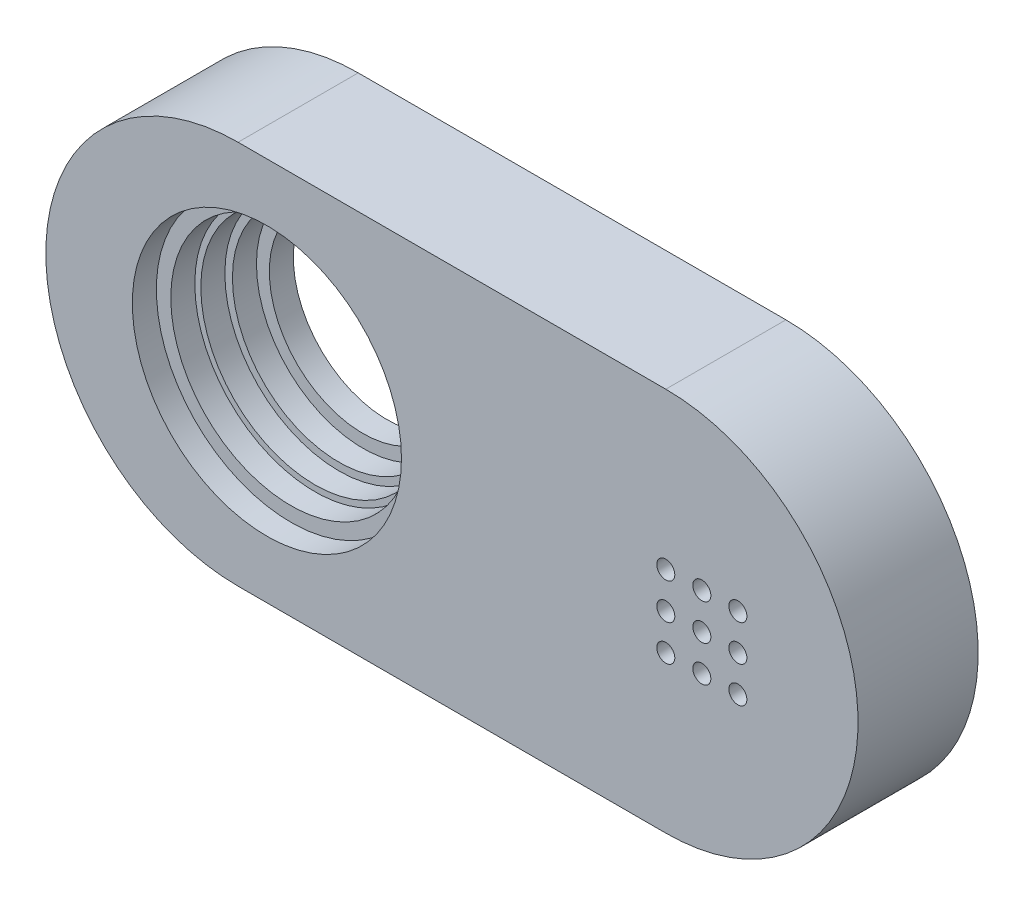
ISO-10303-21;
HEADER;
FILE_DESCRIPTION(('STEP AP214'),'2;1');
FILE_NAME('part.step','',(''),(''),'','','');
FILE_SCHEMA(('AUTOMOTIVE_DESIGN { 1 0 10303 214 1 1 1 1 }'));
ENDSEC;
DATA;
#1=APPLICATION_CONTEXT('core data for automotive mechanical design processes');
#2=APPLICATION_PROTOCOL_DEFINITION('international standard','automotive_design',2000,#1);
#3=PRODUCT_CONTEXT('',#1,'mechanical');
#4=PRODUCT('Part','Part','',(#3));
#5=PRODUCT_RELATED_PRODUCT_CATEGORY('part','',(#4));
#6=PRODUCT_DEFINITION_FORMATION('','',#4);
#7=PRODUCT_DEFINITION_CONTEXT('part definition',#1,'design');
#8=PRODUCT_DEFINITION('design','',#6,#7);
#9=PRODUCT_DEFINITION_SHAPE('','',#8);
#10=(LENGTH_UNIT() NAMED_UNIT(*) SI_UNIT(.MILLI.,.METRE.));
#11=(NAMED_UNIT(*) PLANE_ANGLE_UNIT() SI_UNIT($,.RADIAN.));
#12=(NAMED_UNIT(*) SI_UNIT($,.STERADIAN.) SOLID_ANGLE_UNIT());
#13=UNCERTAINTY_MEASURE_WITH_UNIT(LENGTH_MEASURE(1.E-05),#10,'distance_accuracy_value','');
#14=(GEOMETRIC_REPRESENTATION_CONTEXT(3) GLOBAL_UNCERTAINTY_ASSIGNED_CONTEXT((#13)) GLOBAL_UNIT_ASSIGNED_CONTEXT((#10,
#11,#12)) REPRESENTATION_CONTEXT('',''));
#15=CARTESIAN_POINT('',(0.,0.,0.));
#16=DIRECTION('',(0.,0.,1.));
#17=DIRECTION('',(1.,0.,0.));
#18=AXIS2_PLACEMENT_3D('',#15,#16,#17);
#19=CARTESIAN_POINT('',(-7.7,0.,3.));
#20=DIRECTION('',(0.,0.,1.));
#21=DIRECTION('',(1.,0.,0.));
#22=AXIS2_PLACEMENT_3D('',#19,#20,#21);
#23=CYLINDRICAL_SURFACE('',#22,5.);
#24=CARTESIAN_POINT('',(-7.7,0.,3.));
#25=DIRECTION('',(0.,0.,1.));
#26=DIRECTION('',(1.,0.,0.));
#27=AXIS2_PLACEMENT_3D('',#24,#25,#26);
#28=CIRCLE('',#27,5.);
#29=CARTESIAN_POINT('',(-2.7,0.,3.));
#30=VERTEX_POINT('',#29);
#31=EDGE_CURVE('E117',#30,#30,#28,.T.);
#32=ORIENTED_EDGE('',*,*,#31,.F.);
#33=EDGE_LOOP('',(#32));
#34=FACE_BOUND('',#33,.T.);
#35=CARTESIAN_POINT('',(-7.7,0.,4.));
#36=DIRECTION('',(0.,0.,1.));
#37=DIRECTION('',(1.,0.,0.));
#38=AXIS2_PLACEMENT_3D('',#35,#36,#37);
#39=CIRCLE('',#38,5.);
#40=CARTESIAN_POINT('',(-2.7,0.,4.));
#41=VERTEX_POINT('',#40);
#42=EDGE_CURVE('E36',#41,#41,#39,.F.);
#43=ORIENTED_EDGE('',*,*,#42,.F.);
#44=EDGE_LOOP('',(#43));
#45=FACE_BOUND('',#44,.T.);
#46=ADVANCED_FACE('F32',(#34,#45),#23,.F.);
#47=CARTESIAN_POINT('',(-7.7,0.,2.));
#48=DIRECTION('',(0.,0.,1.));
#49=DIRECTION('',(1.,0.,0.));
#50=AXIS2_PLACEMENT_3D('',#47,#48,#49);
#51=CYLINDRICAL_SURFACE('',#50,4.75);
#52=CARTESIAN_POINT('',(-7.7,0.,2.));
#53=DIRECTION('',(0.,0.,1.));
#54=DIRECTION('',(1.,0.,0.));
#55=AXIS2_PLACEMENT_3D('',#52,#53,#54);
#56=CIRCLE('',#55,4.75);
#57=CARTESIAN_POINT('',(-2.95,0.,2.));
#58=VERTEX_POINT('',#57);
#59=EDGE_CURVE('E114',#58,#58,#56,.T.);
#60=ORIENTED_EDGE('',*,*,#59,.F.);
#61=EDGE_LOOP('',(#60));
#62=FACE_BOUND('',#61,.T.);
#63=CARTESIAN_POINT('',(-7.7,0.,3.));
#64=DIRECTION('',(0.,0.,1.));
#65=DIRECTION('',(1.,0.,0.));
#66=AXIS2_PLACEMENT_3D('',#63,#64,#65);
#67=CIRCLE('',#66,4.75);
#68=CARTESIAN_POINT('',(-2.95,0.,3.));
#69=VERTEX_POINT('',#68);
#70=EDGE_CURVE('E115',#69,#69,#67,.F.);
#71=ORIENTED_EDGE('',*,*,#70,.F.);
#72=EDGE_LOOP('',(#71));
#73=FACE_BOUND('',#72,.T.);
#74=ADVANCED_FACE('F164',(#62,#73),#51,.F.);
#75=CARTESIAN_POINT('',(-7.7,0.,1.));
#76=DIRECTION('',(0.,0.,1.));
#77=DIRECTION('',(1.,0.,0.));
#78=AXIS2_PLACEMENT_3D('',#75,#76,#77);
#79=CYLINDRICAL_SURFACE('',#78,4.435);
#80=CARTESIAN_POINT('',(-7.7,0.,1.));
#81=DIRECTION('',(0.,0.,1.));
#82=DIRECTION('',(1.,0.,0.));
#83=AXIS2_PLACEMENT_3D('',#80,#81,#82);
#84=CIRCLE('',#83,4.435);
#85=CARTESIAN_POINT('',(-3.265,0.,1.));
#86=VERTEX_POINT('',#85);
#87=EDGE_CURVE('E111',#86,#86,#84,.T.);
#88=ORIENTED_EDGE('',*,*,#87,.F.);
#89=EDGE_LOOP('',(#88));
#90=FACE_BOUND('',#89,.T.);
#91=CARTESIAN_POINT('',(-7.7,0.,2.));
#92=DIRECTION('',(0.,0.,1.));
#93=DIRECTION('',(1.,0.,0.));
#94=AXIS2_PLACEMENT_3D('',#91,#92,#93);
#95=CIRCLE('',#94,4.435);
#96=CARTESIAN_POINT('',(-3.265,0.,2.));
#97=VERTEX_POINT('',#96);
#98=EDGE_CURVE('E112',#97,#97,#95,.F.);
#99=ORIENTED_EDGE('',*,*,#98,.F.);
#100=EDGE_LOOP('',(#99));
#101=FACE_BOUND('',#100,.T.);
#102=ADVANCED_FACE('F143',(#90,#101),#79,.F.);
#103=CARTESIAN_POINT('',(-7.7,0.,0.));
#104=DIRECTION('',(0.,0.,1.));
#105=DIRECTION('',(1.,0.,0.));
#106=AXIS2_PLACEMENT_3D('',#103,#104,#105);
#107=CYLINDRICAL_SURFACE('',#106,3.9);
#108=CARTESIAN_POINT('',(-7.7,0.,0.));
#109=DIRECTION('',(0.,0.,1.));
#110=DIRECTION('',(1.,0.,0.));
#111=AXIS2_PLACEMENT_3D('',#108,#109,#110);
#112=CIRCLE('',#111,3.9);
#113=CARTESIAN_POINT('',(-3.8,0.,0.));
#114=VERTEX_POINT('',#113);
#115=EDGE_CURVE('E102',#114,#114,#112,.T.);
#116=ORIENTED_EDGE('',*,*,#115,.F.);
#117=EDGE_LOOP('',(#116));
#118=FACE_BOUND('',#117,.T.);
#119=CARTESIAN_POINT('',(-7.7,0.,1.));
#120=DIRECTION('',(0.,0.,1.));
#121=DIRECTION('',(1.,0.,0.));
#122=AXIS2_PLACEMENT_3D('',#119,#120,#121);
#123=CIRCLE('',#122,3.9);
#124=CARTESIAN_POINT('',(-3.8,0.,1.));
#125=VERTEX_POINT('',#124);
#126=EDGE_CURVE('E108',#125,#125,#123,.F.);
#127=ORIENTED_EDGE('',*,*,#126,.F.);
#128=EDGE_LOOP('',(#127));
#129=FACE_BOUND('',#128,.T.);
#130=ADVANCED_FACE('F140',(#118,#129),#107,.F.);
#131=CARTESIAN_POINT('',(-8.9,0.,5.));
#132=DIRECTION('',(0.,0.,-1.));
#133=DIRECTION('',(-1.,0.,0.));
#134=AXIS2_PLACEMENT_3D('',#131,#132,#133);
#135=CYLINDRICAL_SURFACE('',#134,8.);
#136=CARTESIAN_POINT('',(-8.9,0.,0.));
#137=DIRECTION('',(0.,0.,1.));
#138=DIRECTION('',(1.,0.,0.));
#139=AXIS2_PLACEMENT_3D('',#136,#137,#138);
#140=CIRCLE('',#139,8.);
#141=CARTESIAN_POINT('',(-8.9,8.,0.));
#142=VERTEX_POINT('',#141);
#143=CARTESIAN_POINT('',(-8.9,-8.,0.));
#144=VERTEX_POINT('',#143);
#145=EDGE_CURVE('E99',#142,#144,#140,.T.);
#146=ORIENTED_EDGE('',*,*,#145,.T.);
#147=DIRECTION('',(0.,0.,-1.));
#148=VECTOR('',#147,1.);
#149=CARTESIAN_POINT('',(-8.9,-8.,5.));
#150=LINE('',#149,#148);
#151=CARTESIAN_POINT('',(-8.9,-8.,5.));
#152=VERTEX_POINT('',#151);
#153=EDGE_CURVE('E11',#152,#144,#150,.T.);
#154=ORIENTED_EDGE('',*,*,#153,.F.);
#155=CARTESIAN_POINT('',(-8.9,0.,5.));
#156=DIRECTION('',(0.,0.,1.));
#157=DIRECTION('',(1.,0.,0.));
#158=AXIS2_PLACEMENT_3D('',#155,#156,#157);
#159=CIRCLE('',#158,8.);
#160=CARTESIAN_POINT('',(-8.9,8.,5.));
#161=VERTEX_POINT('',#160);
#162=EDGE_CURVE('E86',#161,#152,#159,.T.);
#163=ORIENTED_EDGE('',*,*,#162,.F.);
#164=DIRECTION('',(0.,0.,-1.));
#165=VECTOR('',#164,1.);
#166=CARTESIAN_POINT('',(-8.9,8.,5.));
#167=LINE('',#166,#165);
#168=EDGE_CURVE('E95',#161,#142,#167,.T.);
#169=ORIENTED_EDGE('',*,*,#168,.T.);
#170=EDGE_LOOP('',(#146,#154,#163,#169));
#171=FACE_BOUND('',#170,.T.);
#172=ADVANCED_FACE('F34',(#171),#135,.T.);
#173=CARTESIAN_POINT('',(-8.9,-8.,5.));
#174=DIRECTION('',(0.,1.,0.));
#175=DIRECTION('',(-1.,0.,0.));
#176=AXIS2_PLACEMENT_3D('',#173,#174,#175);
#177=PLANE('',#176);
#178=DIRECTION('',(1.,0.,0.));
#179=VECTOR('',#178,1.);
#180=CARTESIAN_POINT('',(-8.9,-8.,0.));
#181=LINE('',#180,#179);
#182=CARTESIAN_POINT('',(8.9,-8.,0.));
#183=VERTEX_POINT('',#182);
#184=EDGE_CURVE('E90',#144,#183,#181,.T.);
#185=ORIENTED_EDGE('',*,*,#184,.T.);
#186=DIRECTION('',(0.,0.,-1.));
#187=VECTOR('',#186,1.);
#188=CARTESIAN_POINT('',(8.9,-8.,5.));
#189=LINE('',#188,#187);
#190=CARTESIAN_POINT('',(8.9,-8.,5.));
#191=VERTEX_POINT('',#190);
#192=EDGE_CURVE('E42',#191,#183,#189,.T.);
#193=ORIENTED_EDGE('',*,*,#192,.F.);
#194=DIRECTION('',(1.,0.,0.));
#195=VECTOR('',#194,1.);
#196=CARTESIAN_POINT('',(-8.9,-8.,5.));
#197=LINE('',#196,#195);
#198=EDGE_CURVE('E81',#152,#191,#197,.T.);
#199=ORIENTED_EDGE('',*,*,#198,.F.);
#200=ORIENTED_EDGE('',*,*,#153,.T.);
#201=EDGE_LOOP('',(#185,#193,#199,#200));
#202=FACE_BOUND('',#201,.T.);
#203=ADVANCED_FACE('F89',(#202),#177,.F.);
#204=CARTESIAN_POINT('',(8.9,0.,5.));
#205=DIRECTION('',(0.,0.,-1.));
#206=DIRECTION('',(-1.,0.,0.));
#207=AXIS2_PLACEMENT_3D('',#204,#205,#206);
#208=CYLINDRICAL_SURFACE('',#207,8.);
#209=CARTESIAN_POINT('',(8.9,0.,0.));
#210=DIRECTION('',(0.,0.,1.));
#211=DIRECTION('',(1.,0.,0.));
#212=AXIS2_PLACEMENT_3D('',#209,#210,#211);
#213=CIRCLE('',#212,8.);
#214=CARTESIAN_POINT('',(8.9,8.,0.));
#215=VERTEX_POINT('',#214);
#216=EDGE_CURVE('E68',#183,#215,#213,.T.);
#217=ORIENTED_EDGE('',*,*,#216,.T.);
#218=DIRECTION('',(0.,0.,-1.));
#219=VECTOR('',#218,1.);
#220=CARTESIAN_POINT('',(8.9,8.,5.));
#221=LINE('',#220,#219);
#222=CARTESIAN_POINT('',(8.9,8.,5.));
#223=VERTEX_POINT('',#222);
#224=EDGE_CURVE('E91',#223,#215,#221,.T.);
#225=ORIENTED_EDGE('',*,*,#224,.F.);
#226=CARTESIAN_POINT('',(8.9,0.,5.));
#227=DIRECTION('',(0.,0.,1.));
#228=DIRECTION('',(1.,0.,0.));
#229=AXIS2_PLACEMENT_3D('',#226,#227,#228);
#230=CIRCLE('',#229,8.);
#231=EDGE_CURVE('E84',#191,#223,#230,.T.);
#232=ORIENTED_EDGE('',*,*,#231,.F.);
#233=ORIENTED_EDGE('',*,*,#192,.T.);
#234=EDGE_LOOP('',(#217,#225,#232,#233));
#235=FACE_BOUND('',#234,.T.);
#236=ADVANCED_FACE('F93',(#235),#208,.T.);
#237=CARTESIAN_POINT('',(-8.9,8.,5.));
#238=DIRECTION('',(0.,-1.,0.));
#239=DIRECTION('',(1.,0.,0.));
#240=AXIS2_PLACEMENT_3D('',#237,#238,#239);
#241=PLANE('',#240);
#242=DIRECTION('',(-1.,0.,0.));
#243=VECTOR('',#242,1.);
#244=CARTESIAN_POINT('',(-8.9,8.,0.));
#245=LINE('',#244,#243);
#246=EDGE_CURVE('E74',#215,#142,#245,.T.);
#247=ORIENTED_EDGE('',*,*,#246,.T.);
#248=ORIENTED_EDGE('',*,*,#168,.F.);
#249=DIRECTION('',(-1.,0.,0.));
#250=VECTOR('',#249,1.);
#251=CARTESIAN_POINT('',(-8.9,8.,5.));
#252=LINE('',#251,#250);
#253=EDGE_CURVE('E51',#223,#161,#252,.T.);
#254=ORIENTED_EDGE('',*,*,#253,.F.);
#255=ORIENTED_EDGE('',*,*,#224,.T.);
#256=EDGE_LOOP('',(#247,#248,#254,#255));
#257=FACE_BOUND('',#256,.T.);
#258=ADVANCED_FACE('F285',(#257),#241,.F.);
#259=CARTESIAN_POINT('',(-8.9,0.,5.));
#260=DIRECTION('',(0.,0.,1.));
#261=DIRECTION('',(1.,0.,0.));
#262=AXIS2_PLACEMENT_3D('',#259,#260,#261);
#263=PLANE('',#262);
#264=CARTESIAN_POINT('',(11.9,1.5,5.));
#265=DIRECTION('',(0.,0.,1.));
#266=DIRECTION('',(1.,0.,0.));
#267=AXIS2_PLACEMENT_3D('',#264,#265,#266);
#268=CIRCLE('',#267,0.375000000000001);
#269=CARTESIAN_POINT('',(12.275,1.5,5.));
#270=VERTEX_POINT('',#269);
#271=EDGE_CURVE('E226',#270,#270,#268,.T.);
#272=ORIENTED_EDGE('',*,*,#271,.F.);
#273=EDGE_LOOP('',(#272));
#274=FACE_BOUND('',#273,.T.);
#275=CARTESIAN_POINT('',(10.4,1.5,5.));
#276=DIRECTION('',(0.,0.,1.));
#277=DIRECTION('',(1.,0.,0.));
#278=AXIS2_PLACEMENT_3D('',#275,#276,#277);
#279=CIRCLE('',#278,0.375000000000001);
#280=CARTESIAN_POINT('',(10.775,1.5,5.));
#281=VERTEX_POINT('',#280);
#282=EDGE_CURVE('E229',#281,#281,#279,.T.);
#283=ORIENTED_EDGE('',*,*,#282,.F.);
#284=EDGE_LOOP('',(#283));
#285=FACE_BOUND('',#284,.T.);
#286=CARTESIAN_POINT('',(8.9,1.5,5.));
#287=DIRECTION('',(0.,0.,1.));
#288=DIRECTION('',(1.,0.,0.));
#289=AXIS2_PLACEMENT_3D('',#286,#287,#288);
#290=CIRCLE('',#289,0.375000000000001);
#291=CARTESIAN_POINT('',(9.275,1.5,5.));
#292=VERTEX_POINT('',#291);
#293=EDGE_CURVE('E235',#292,#292,#290,.T.);
#294=ORIENTED_EDGE('',*,*,#293,.F.);
#295=EDGE_LOOP('',(#294));
#296=FACE_BOUND('',#295,.T.);
#297=CARTESIAN_POINT('',(11.9,-1.5,5.));
#298=DIRECTION('',(0.,0.,1.));
#299=DIRECTION('',(1.,0.,0.));
#300=AXIS2_PLACEMENT_3D('',#297,#298,#299);
#301=CIRCLE('',#300,0.375000000000001);
#302=CARTESIAN_POINT('',(12.275,-1.5,5.));
#303=VERTEX_POINT('',#302);
#304=EDGE_CURVE('E241',#303,#303,#301,.T.);
#305=ORIENTED_EDGE('',*,*,#304,.F.);
#306=EDGE_LOOP('',(#305));
#307=FACE_BOUND('',#306,.T.);
#308=CARTESIAN_POINT('',(10.4,-1.5,5.));
#309=DIRECTION('',(0.,0.,1.));
#310=DIRECTION('',(1.,0.,0.));
#311=AXIS2_PLACEMENT_3D('',#308,#309,#310);
#312=CIRCLE('',#311,0.375000000000001);
#313=CARTESIAN_POINT('',(10.775,-1.5,5.));
#314=VERTEX_POINT('',#313);
#315=EDGE_CURVE('E247',#314,#314,#312,.T.);
#316=ORIENTED_EDGE('',*,*,#315,.F.);
#317=EDGE_LOOP('',(#316));
#318=FACE_BOUND('',#317,.T.);
#319=CARTESIAN_POINT('',(8.9,-1.5,5.));
#320=DIRECTION('',(0.,0.,1.));
#321=DIRECTION('',(1.,0.,0.));
#322=AXIS2_PLACEMENT_3D('',#319,#320,#321);
#323=CIRCLE('',#322,0.375000000000001);
#324=CARTESIAN_POINT('',(9.275,-1.5,5.));
#325=VERTEX_POINT('',#324);
#326=EDGE_CURVE('E253',#325,#325,#323,.T.);
#327=ORIENTED_EDGE('',*,*,#326,.F.);
#328=EDGE_LOOP('',(#327));
#329=FACE_BOUND('',#328,.T.);
#330=CARTESIAN_POINT('',(11.9,0.,5.));
#331=DIRECTION('',(0.,0.,1.));
#332=DIRECTION('',(1.,0.,0.));
#333=AXIS2_PLACEMENT_3D('',#330,#331,#332);
#334=CIRCLE('',#333,0.375000000000001);
#335=CARTESIAN_POINT('',(12.275,0.,5.));
#336=VERTEX_POINT('',#335);
#337=EDGE_CURVE('E259',#336,#336,#334,.T.);
#338=ORIENTED_EDGE('',*,*,#337,.F.);
#339=EDGE_LOOP('',(#338));
#340=FACE_BOUND('',#339,.T.);
#341=CARTESIAN_POINT('',(8.9,0.,5.));
#342=DIRECTION('',(0.,0.,1.));
#343=DIRECTION('',(1.,0.,0.));
#344=AXIS2_PLACEMENT_3D('',#341,#342,#343);
#345=CIRCLE('',#344,0.375000000000001);
#346=CARTESIAN_POINT('',(9.275,0.,5.));
#347=VERTEX_POINT('',#346);
#348=EDGE_CURVE('E265',#347,#347,#345,.T.);
#349=ORIENTED_EDGE('',*,*,#348,.F.);
#350=EDGE_LOOP('',(#349));
#351=FACE_BOUND('',#350,.T.);
#352=CARTESIAN_POINT('',(10.4,0.,5.));
#353=DIRECTION('',(0.,0.,1.));
#354=DIRECTION('',(1.,0.,0.));
#355=AXIS2_PLACEMENT_3D('',#352,#353,#354);
#356=CIRCLE('',#355,0.375000000000001);
#357=CARTESIAN_POINT('',(10.775,0.,5.));
#358=VERTEX_POINT('',#357);
#359=EDGE_CURVE('E271',#358,#358,#356,.T.);
#360=ORIENTED_EDGE('',*,*,#359,.F.);
#361=EDGE_LOOP('',(#360));
#362=FACE_BOUND('',#361,.T.);
#363=CARTESIAN_POINT('',(-7.7,0.,5.));
#364=DIRECTION('',(0.,0.,1.));
#365=DIRECTION('',(1.,0.,0.));
#366=AXIS2_PLACEMENT_3D('',#363,#364,#365);
#367=CIRCLE('',#366,5.6);
#368=CARTESIAN_POINT('',(-2.1,0.,5.));
#369=VERTEX_POINT('',#368);
#370=EDGE_CURVE('E129',#369,#369,#367,.T.);
#371=ORIENTED_EDGE('',*,*,#370,.F.);
#372=EDGE_LOOP('',(#371));
#373=FACE_BOUND('',#372,.T.);
#374=ORIENTED_EDGE('',*,*,#162,.T.);
#375=ORIENTED_EDGE('',*,*,#198,.T.);
#376=ORIENTED_EDGE('',*,*,#231,.T.);
#377=ORIENTED_EDGE('',*,*,#253,.T.);
#378=EDGE_LOOP('',(#374,#375,#376,#377));
#379=FACE_BOUND('',#378,.T.);
#380=ADVANCED_FACE('F82',(#274,#285,#296,#307,#318,#329,#340,#351,#362,#373,#379),#263,.T.);
#381=CARTESIAN_POINT('',(-8.9,0.,0.));
#382=DIRECTION('',(0.,0.,1.));
#383=DIRECTION('',(1.,0.,0.));
#384=AXIS2_PLACEMENT_3D('',#381,#382,#383);
#385=PLANE('',#384);
#386=CARTESIAN_POINT('',(11.9,1.5,0.));
#387=DIRECTION('',(0.,0.,1.));
#388=DIRECTION('',(1.,0.,0.));
#389=AXIS2_PLACEMENT_3D('',#386,#387,#388);
#390=CIRCLE('',#389,0.375000000000001);
#391=CARTESIAN_POINT('',(12.275,1.5,0.));
#392=VERTEX_POINT('',#391);
#393=EDGE_CURVE('E223',#392,#392,#390,.T.);
#394=ORIENTED_EDGE('',*,*,#393,.T.);
#395=EDGE_LOOP('',(#394));
#396=FACE_BOUND('',#395,.T.);
#397=CARTESIAN_POINT('',(10.4,1.5,0.));
#398=DIRECTION('',(0.,0.,1.));
#399=DIRECTION('',(1.,0.,0.));
#400=AXIS2_PLACEMENT_3D('',#397,#398,#399);
#401=CIRCLE('',#400,0.375000000000001);
#402=CARTESIAN_POINT('',(10.775,1.5,0.));
#403=VERTEX_POINT('',#402);
#404=EDGE_CURVE('E232',#403,#403,#401,.T.);
#405=ORIENTED_EDGE('',*,*,#404,.T.);
#406=EDGE_LOOP('',(#405));
#407=FACE_BOUND('',#406,.T.);
#408=CARTESIAN_POINT('',(8.9,1.5,0.));
#409=DIRECTION('',(0.,0.,1.));
#410=DIRECTION('',(1.,0.,0.));
#411=AXIS2_PLACEMENT_3D('',#408,#409,#410);
#412=CIRCLE('',#411,0.375000000000001);
#413=CARTESIAN_POINT('',(9.275,1.5,0.));
#414=VERTEX_POINT('',#413);
#415=EDGE_CURVE('E238',#414,#414,#412,.T.);
#416=ORIENTED_EDGE('',*,*,#415,.T.);
#417=EDGE_LOOP('',(#416));
#418=FACE_BOUND('',#417,.T.);
#419=CARTESIAN_POINT('',(11.9,-1.5,0.));
#420=DIRECTION('',(0.,0.,1.));
#421=DIRECTION('',(1.,0.,0.));
#422=AXIS2_PLACEMENT_3D('',#419,#420,#421);
#423=CIRCLE('',#422,0.375000000000001);
#424=CARTESIAN_POINT('',(12.275,-1.5,0.));
#425=VERTEX_POINT('',#424);
#426=EDGE_CURVE('E244',#425,#425,#423,.T.);
#427=ORIENTED_EDGE('',*,*,#426,.T.);
#428=EDGE_LOOP('',(#427));
#429=FACE_BOUND('',#428,.T.);
#430=CARTESIAN_POINT('',(10.4,-1.5,0.));
#431=DIRECTION('',(0.,0.,1.));
#432=DIRECTION('',(1.,0.,0.));
#433=AXIS2_PLACEMENT_3D('',#430,#431,#432);
#434=CIRCLE('',#433,0.375000000000001);
#435=CARTESIAN_POINT('',(10.775,-1.5,0.));
#436=VERTEX_POINT('',#435);
#437=EDGE_CURVE('E250',#436,#436,#434,.T.);
#438=ORIENTED_EDGE('',*,*,#437,.T.);
#439=EDGE_LOOP('',(#438));
#440=FACE_BOUND('',#439,.T.);
#441=CARTESIAN_POINT('',(8.9,-1.5,0.));
#442=DIRECTION('',(0.,0.,1.));
#443=DIRECTION('',(1.,0.,0.));
#444=AXIS2_PLACEMENT_3D('',#441,#442,#443);
#445=CIRCLE('',#444,0.375000000000001);
#446=CARTESIAN_POINT('',(9.275,-1.5,0.));
#447=VERTEX_POINT('',#446);
#448=EDGE_CURVE('E256',#447,#447,#445,.T.);
#449=ORIENTED_EDGE('',*,*,#448,.T.);
#450=EDGE_LOOP('',(#449));
#451=FACE_BOUND('',#450,.T.);
#452=CARTESIAN_POINT('',(11.9,0.,0.));
#453=DIRECTION('',(0.,0.,1.));
#454=DIRECTION('',(1.,0.,0.));
#455=AXIS2_PLACEMENT_3D('',#452,#453,#454);
#456=CIRCLE('',#455,0.375000000000001);
#457=CARTESIAN_POINT('',(12.275,0.,0.));
#458=VERTEX_POINT('',#457);
#459=EDGE_CURVE('E262',#458,#458,#456,.T.);
#460=ORIENTED_EDGE('',*,*,#459,.T.);
#461=EDGE_LOOP('',(#460));
#462=FACE_BOUND('',#461,.T.);
#463=CARTESIAN_POINT('',(8.9,0.,0.));
#464=DIRECTION('',(0.,0.,1.));
#465=DIRECTION('',(1.,0.,0.));
#466=AXIS2_PLACEMENT_3D('',#463,#464,#465);
#467=CIRCLE('',#466,0.375000000000001);
#468=CARTESIAN_POINT('',(9.275,0.,0.));
#469=VERTEX_POINT('',#468);
#470=EDGE_CURVE('E268',#469,#469,#467,.T.);
#471=ORIENTED_EDGE('',*,*,#470,.T.);
#472=EDGE_LOOP('',(#471));
#473=FACE_BOUND('',#472,.T.);
#474=CARTESIAN_POINT('',(10.4,0.,0.));
#475=DIRECTION('',(0.,0.,1.));
#476=DIRECTION('',(1.,0.,0.));
#477=AXIS2_PLACEMENT_3D('',#474,#475,#476);
#478=CIRCLE('',#477,0.375000000000001);
#479=CARTESIAN_POINT('',(10.775,0.,0.));
#480=VERTEX_POINT('',#479);
#481=EDGE_CURVE('E274',#480,#480,#478,.T.);
#482=ORIENTED_EDGE('',*,*,#481,.T.);
#483=EDGE_LOOP('',(#482));
#484=FACE_BOUND('',#483,.T.);
#485=ORIENTED_EDGE('',*,*,#115,.T.);
#486=EDGE_LOOP('',(#485));
#487=FACE_BOUND('',#486,.T.);
#488=ORIENTED_EDGE('',*,*,#145,.F.);
#489=ORIENTED_EDGE('',*,*,#246,.F.);
#490=ORIENTED_EDGE('',*,*,#216,.F.);
#491=ORIENTED_EDGE('',*,*,#184,.F.);
#492=EDGE_LOOP('',(#488,#489,#490,#491));
#493=FACE_BOUND('',#492,.T.);
#494=ADVANCED_FACE('F137',(#396,#407,#418,#429,#440,#451,#462,#473,#484,#487,#493),#385,.F.);
#495=CARTESIAN_POINT('',(-7.7,0.,1.));
#496=DIRECTION('',(0.,0.,1.));
#497=DIRECTION('',(1.,0.,0.));
#498=AXIS2_PLACEMENT_3D('',#495,#496,#497);
#499=PLANE('',#498);
#500=ORIENTED_EDGE('',*,*,#87,.T.);
#501=EDGE_LOOP('',(#500));
#502=FACE_BOUND('',#501,.T.);
#503=ORIENTED_EDGE('',*,*,#126,.T.);
#504=EDGE_LOOP('',(#503));
#505=FACE_BOUND('',#504,.T.);
#506=ADVANCED_FACE('F147',(#502,#505),#499,.T.);
#507=CARTESIAN_POINT('',(-7.7,0.,2.));
#508=DIRECTION('',(0.,0.,1.));
#509=DIRECTION('',(1.,0.,0.));
#510=AXIS2_PLACEMENT_3D('',#507,#508,#509);
#511=PLANE('',#510);
#512=ORIENTED_EDGE('',*,*,#59,.T.);
#513=EDGE_LOOP('',(#512));
#514=FACE_BOUND('',#513,.T.);
#515=ORIENTED_EDGE('',*,*,#98,.T.);
#516=EDGE_LOOP('',(#515));
#517=FACE_BOUND('',#516,.T.);
#518=ADVANCED_FACE('F149',(#514,#517),#511,.T.);
#519=CARTESIAN_POINT('',(-7.7,0.,3.));
#520=DIRECTION('',(0.,0.,1.));
#521=DIRECTION('',(1.,0.,0.));
#522=AXIS2_PLACEMENT_3D('',#519,#520,#521);
#523=PLANE('',#522);
#524=ORIENTED_EDGE('',*,*,#31,.T.);
#525=EDGE_LOOP('',(#524));
#526=FACE_BOUND('',#525,.T.);
#527=ORIENTED_EDGE('',*,*,#70,.T.);
#528=EDGE_LOOP('',(#527));
#529=FACE_BOUND('',#528,.T.);
#530=ADVANCED_FACE('F156',(#526,#529),#523,.T.);
#531=CARTESIAN_POINT('',(-7.7,0.,4.));
#532=DIRECTION('',(0.,0.,1.));
#533=DIRECTION('',(1.,0.,0.));
#534=AXIS2_PLACEMENT_3D('',#531,#532,#533);
#535=PLANE('',#534);
#536=CARTESIAN_POINT('',(-7.7,0.,4.));
#537=DIRECTION('',(0.,0.,1.));
#538=DIRECTION('',(1.,0.,0.));
#539=AXIS2_PLACEMENT_3D('',#536,#537,#538);
#540=CIRCLE('',#539,5.6);
#541=CARTESIAN_POINT('',(-2.1,0.,4.));
#542=VERTEX_POINT('',#541);
#543=EDGE_CURVE('E127',#542,#542,#540,.T.);
#544=ORIENTED_EDGE('',*,*,#543,.T.);
#545=EDGE_LOOP('',(#544));
#546=FACE_BOUND('',#545,.T.);
#547=ORIENTED_EDGE('',*,*,#42,.T.);
#548=EDGE_LOOP('',(#547));
#549=FACE_BOUND('',#548,.T.);
#550=ADVANCED_FACE('F175',(#546,#549),#535,.T.);
#551=CARTESIAN_POINT('',(-7.7,0.,4.));
#552=DIRECTION('',(0.,0.,1.));
#553=DIRECTION('',(1.,0.,0.));
#554=AXIS2_PLACEMENT_3D('',#551,#552,#553);
#555=CYLINDRICAL_SURFACE('',#554,5.6);
#556=ORIENTED_EDGE('',*,*,#543,.F.);
#557=EDGE_LOOP('',(#556));
#558=FACE_BOUND('',#557,.T.);
#559=ORIENTED_EDGE('',*,*,#370,.T.);
#560=EDGE_LOOP('',(#559));
#561=FACE_BOUND('',#560,.T.);
#562=ADVANCED_FACE('F176',(#558,#561),#555,.F.);
#563=CARTESIAN_POINT('',(10.4,0.,0.));
#564=DIRECTION('',(0.,0.,1.));
#565=DIRECTION('',(1.,0.,0.));
#566=AXIS2_PLACEMENT_3D('',#563,#564,#565);
#567=CYLINDRICAL_SURFACE('',#566,0.375000000000001);
#568=ORIENTED_EDGE('',*,*,#481,.F.);
#569=EDGE_LOOP('',(#568));
#570=FACE_BOUND('',#569,.T.);
#571=ORIENTED_EDGE('',*,*,#359,.T.);
#572=EDGE_LOOP('',(#571));
#573=FACE_BOUND('',#572,.T.);
#574=ADVANCED_FACE('F179',(#570,#573),#567,.F.);
#575=CARTESIAN_POINT('',(8.9,0.,0.));
#576=DIRECTION('',(0.,0.,1.));
#577=DIRECTION('',(1.,0.,0.));
#578=AXIS2_PLACEMENT_3D('',#575,#576,#577);
#579=CYLINDRICAL_SURFACE('',#578,0.375000000000001);
#580=ORIENTED_EDGE('',*,*,#470,.F.);
#581=EDGE_LOOP('',(#580));
#582=FACE_BOUND('',#581,.T.);
#583=ORIENTED_EDGE('',*,*,#348,.T.);
#584=EDGE_LOOP('',(#583));
#585=FACE_BOUND('',#584,.T.);
#586=ADVANCED_FACE('F186',(#582,#585),#579,.F.);
#587=CARTESIAN_POINT('',(11.9,0.,0.));
#588=DIRECTION('',(0.,0.,1.));
#589=DIRECTION('',(1.,0.,0.));
#590=AXIS2_PLACEMENT_3D('',#587,#588,#589);
#591=CYLINDRICAL_SURFACE('',#590,0.375000000000001);
#592=ORIENTED_EDGE('',*,*,#459,.F.);
#593=EDGE_LOOP('',(#592));
#594=FACE_BOUND('',#593,.T.);
#595=ORIENTED_EDGE('',*,*,#337,.T.);
#596=EDGE_LOOP('',(#595));
#597=FACE_BOUND('',#596,.T.);
#598=ADVANCED_FACE('F190',(#594,#597),#591,.F.);
#599=CARTESIAN_POINT('',(8.9,-1.5,0.));
#600=DIRECTION('',(0.,0.,1.));
#601=DIRECTION('',(1.,0.,0.));
#602=AXIS2_PLACEMENT_3D('',#599,#600,#601);
#603=CYLINDRICAL_SURFACE('',#602,0.375000000000001);
#604=ORIENTED_EDGE('',*,*,#448,.F.);
#605=EDGE_LOOP('',(#604));
#606=FACE_BOUND('',#605,.T.);
#607=ORIENTED_EDGE('',*,*,#326,.T.);
#608=EDGE_LOOP('',(#607));
#609=FACE_BOUND('',#608,.T.);
#610=ADVANCED_FACE('F194',(#606,#609),#603,.F.);
#611=CARTESIAN_POINT('',(10.4,-1.5,0.));
#612=DIRECTION('',(0.,0.,1.));
#613=DIRECTION('',(1.,0.,0.));
#614=AXIS2_PLACEMENT_3D('',#611,#612,#613);
#615=CYLINDRICAL_SURFACE('',#614,0.375000000000001);
#616=ORIENTED_EDGE('',*,*,#437,.F.);
#617=EDGE_LOOP('',(#616));
#618=FACE_BOUND('',#617,.T.);
#619=ORIENTED_EDGE('',*,*,#315,.T.);
#620=EDGE_LOOP('',(#619));
#621=FACE_BOUND('',#620,.T.);
#622=ADVANCED_FACE('F198',(#618,#621),#615,.F.);
#623=CARTESIAN_POINT('',(11.9,-1.5,0.));
#624=DIRECTION('',(0.,0.,1.));
#625=DIRECTION('',(1.,0.,0.));
#626=AXIS2_PLACEMENT_3D('',#623,#624,#625);
#627=CYLINDRICAL_SURFACE('',#626,0.375000000000001);
#628=ORIENTED_EDGE('',*,*,#426,.F.);
#629=EDGE_LOOP('',(#628));
#630=FACE_BOUND('',#629,.T.);
#631=ORIENTED_EDGE('',*,*,#304,.T.);
#632=EDGE_LOOP('',(#631));
#633=FACE_BOUND('',#632,.T.);
#634=ADVANCED_FACE('F202',(#630,#633),#627,.F.);
#635=CARTESIAN_POINT('',(8.9,1.5,0.));
#636=DIRECTION('',(0.,0.,1.));
#637=DIRECTION('',(1.,0.,0.));
#638=AXIS2_PLACEMENT_3D('',#635,#636,#637);
#639=CYLINDRICAL_SURFACE('',#638,0.375000000000001);
#640=ORIENTED_EDGE('',*,*,#415,.F.);
#641=EDGE_LOOP('',(#640));
#642=FACE_BOUND('',#641,.T.);
#643=ORIENTED_EDGE('',*,*,#293,.T.);
#644=EDGE_LOOP('',(#643));
#645=FACE_BOUND('',#644,.T.);
#646=ADVANCED_FACE('F206',(#642,#645),#639,.F.);
#647=CARTESIAN_POINT('',(10.4,1.5,0.));
#648=DIRECTION('',(0.,0.,1.));
#649=DIRECTION('',(1.,0.,0.));
#650=AXIS2_PLACEMENT_3D('',#647,#648,#649);
#651=CYLINDRICAL_SURFACE('',#650,0.375000000000001);
#652=ORIENTED_EDGE('',*,*,#404,.F.);
#653=EDGE_LOOP('',(#652));
#654=FACE_BOUND('',#653,.T.);
#655=ORIENTED_EDGE('',*,*,#282,.T.);
#656=EDGE_LOOP('',(#655));
#657=FACE_BOUND('',#656,.T.);
#658=ADVANCED_FACE('F210',(#654,#657),#651,.F.);
#659=CARTESIAN_POINT('',(11.9,1.5,0.));
#660=DIRECTION('',(0.,0.,1.));
#661=DIRECTION('',(1.,0.,0.));
#662=AXIS2_PLACEMENT_3D('',#659,#660,#661);
#663=CYLINDRICAL_SURFACE('',#662,0.375000000000001);
#664=ORIENTED_EDGE('',*,*,#393,.F.);
#665=EDGE_LOOP('',(#664));
#666=FACE_BOUND('',#665,.T.);
#667=ORIENTED_EDGE('',*,*,#271,.T.);
#668=EDGE_LOOP('',(#667));
#669=FACE_BOUND('',#668,.T.);
#670=ADVANCED_FACE('F214',(#666,#669),#663,.F.);
#671=CLOSED_SHELL('',(#46,#74,#102,#130,#172,#203,#236,#258,#380,#494,#506,#518,#530,#550,#562,
#574,#586,#598,#610,#622,#634,#646,#658,#670));
#672=MANIFOLD_SOLID_BREP('B2',#671);
#673=ADVANCED_BREP_SHAPE_REPRESENTATION('',(#18,#672),#14);
#674=SHAPE_DEFINITION_REPRESENTATION(#9,#673);
ENDSEC;
END-ISO-10303-21;
